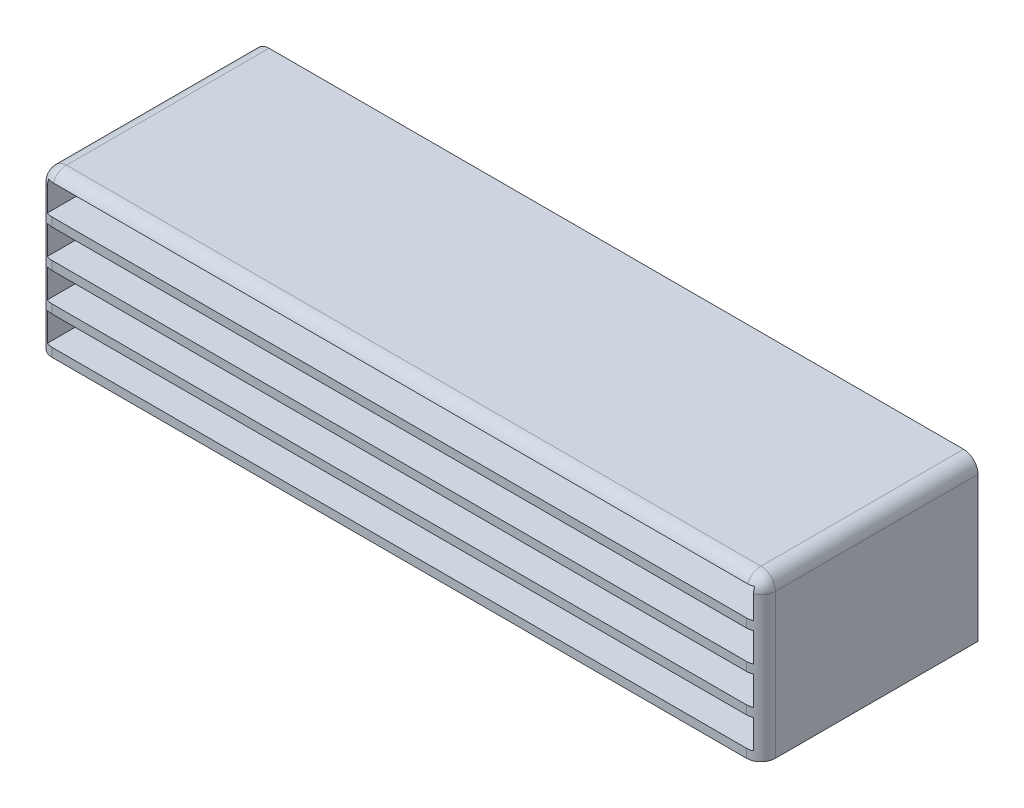
ISO-10303-21;
HEADER;
FILE_DESCRIPTION(('STEP AP214'),'2;1');
FILE_NAME('part.step','',(''),(''),'','','');
FILE_SCHEMA(('AUTOMOTIVE_DESIGN { 1 0 10303 214 1 1 1 1 }'));
ENDSEC;
DATA;
#1=APPLICATION_CONTEXT('core data for automotive mechanical design processes');
#2=APPLICATION_PROTOCOL_DEFINITION('international standard','automotive_design',2000,#1);
#3=PRODUCT_CONTEXT('',#1,'mechanical');
#4=PRODUCT('Part','Part','',(#3));
#5=PRODUCT_RELATED_PRODUCT_CATEGORY('part','',(#4));
#6=PRODUCT_DEFINITION_FORMATION('','',#4);
#7=PRODUCT_DEFINITION_CONTEXT('part definition',#1,'design');
#8=PRODUCT_DEFINITION('design','',#6,#7);
#9=PRODUCT_DEFINITION_SHAPE('','',#8);
#10=(LENGTH_UNIT() NAMED_UNIT(*) SI_UNIT(.MILLI.,.METRE.));
#11=(NAMED_UNIT(*) PLANE_ANGLE_UNIT() SI_UNIT($,.RADIAN.));
#12=(NAMED_UNIT(*) SI_UNIT($,.STERADIAN.) SOLID_ANGLE_UNIT());
#13=UNCERTAINTY_MEASURE_WITH_UNIT(LENGTH_MEASURE(1.E-05),#10,'distance_accuracy_value','');
#14=(GEOMETRIC_REPRESENTATION_CONTEXT(3) GLOBAL_UNCERTAINTY_ASSIGNED_CONTEXT((#13)) GLOBAL_UNIT_ASSIGNED_CONTEXT((#10,
#11,#12)) REPRESENTATION_CONTEXT('',''));
#15=CARTESIAN_POINT('',(0.,0.,0.));
#16=DIRECTION('',(0.,0.,1.));
#17=DIRECTION('',(1.,0.,0.));
#18=AXIS2_PLACEMENT_3D('',#15,#16,#17);
#19=CARTESIAN_POINT('',(0.,0.,75.));
#20=DIRECTION('',(0.,0.,1.));
#21=DIRECTION('',(1.,0.,0.));
#22=AXIS2_PLACEMENT_3D('',#19,#20,#21);
#23=PLANE('',#22);
#24=DIRECTION('',(1.,0.,0.));
#25=VECTOR('',#24,1.);
#26=CARTESIAN_POINT('',(0.,23.9541202925441,75.));
#27=LINE('',#26,#25);
#28=CARTESIAN_POINT('',(-76.8542907423635,23.9541202925441,75.));
#29=VERTEX_POINT('',#28);
#30=CARTESIAN_POINT('',(163.145709257637,23.9541202925441,75.));
#31=VERTEX_POINT('',#30);
#32=EDGE_CURVE('E445',#29,#31,#27,.T.);
#33=ORIENTED_EDGE('',*,*,#32,.T.);
#34=DIRECTION('',(0.,-1.,0.));
#35=VECTOR('',#34,1.);
#36=CARTESIAN_POINT('',(163.145709257637,0.,75.));
#37=LINE('',#36,#35);
#38=CARTESIAN_POINT('',(163.145709257637,26.9541202925441,75.));
#39=VERTEX_POINT('',#38);
#40=EDGE_CURVE('E375',#31,#39,#37,.F.);
#41=ORIENTED_EDGE('',*,*,#40,.T.);
#42=DIRECTION('',(1.,0.,0.));
#43=VECTOR('',#42,1.);
#44=CARTESIAN_POINT('',(0.,26.9541202925441,75.));
#45=LINE('',#44,#43);
#46=CARTESIAN_POINT('',(-76.8542907423632,26.9541202925441,75.));
#47=VERTEX_POINT('',#46);
#48=EDGE_CURVE('E450',#47,#39,#45,.T.);
#49=ORIENTED_EDGE('',*,*,#48,.F.);
#50=DIRECTION('',(0.,-1.,0.));
#51=VECTOR('',#50,1.);
#52=CARTESIAN_POINT('',(-76.8542907423635,23.954120292544,75.));
#53=LINE('',#52,#51);
#54=EDGE_CURVE('E361',#47,#29,#53,.T.);
#55=ORIENTED_EDGE('',*,*,#54,.T.);
#56=EDGE_LOOP('',(#33,#41,#49,#55));
#57=FACE_BOUND('',#56,.T.);
#58=ADVANCED_FACE('F41',(#57),#23,.T.);
#59=DIRECTION('',(1.,0.,0.));
#60=VECTOR('',#59,1.);
#61=CARTESIAN_POINT('',(0.,36.9541202925441,75.));
#62=LINE('',#61,#60);
#63=CARTESIAN_POINT('',(-76.8542907423633,36.9541202925441,75.));
#64=VERTEX_POINT('',#63);
#65=CARTESIAN_POINT('',(163.145709257637,36.9541202925441,75.));
#66=VERTEX_POINT('',#65);
#67=EDGE_CURVE('E456',#64,#66,#62,.T.);
#68=ORIENTED_EDGE('',*,*,#67,.T.);
#69=DIRECTION('',(0.,-1.,0.));
#70=VECTOR('',#69,1.);
#71=CARTESIAN_POINT('',(163.145709257637,0.,75.));
#72=LINE('',#71,#70);
#73=CARTESIAN_POINT('',(163.145709257637,39.9541202925441,75.));
#74=VERTEX_POINT('',#73);
#75=EDGE_CURVE('E373',#66,#74,#72,.F.);
#76=ORIENTED_EDGE('',*,*,#75,.T.);
#77=DIRECTION('',(1.,0.,0.));
#78=VECTOR('',#77,1.);
#79=CARTESIAN_POINT('',(0.,39.9541202925441,75.));
#80=LINE('',#79,#78);
#81=CARTESIAN_POINT('',(-76.8542907423632,39.9541202925441,75.));
#82=VERTEX_POINT('',#81);
#83=EDGE_CURVE('E461',#82,#74,#80,.T.);
#84=ORIENTED_EDGE('',*,*,#83,.F.);
#85=DIRECTION('',(0.,-1.,0.));
#86=VECTOR('',#85,1.);
#87=CARTESIAN_POINT('',(-76.8542907423635,23.954120292544,75.));
#88=LINE('',#87,#86);
#89=EDGE_CURVE('E363',#82,#64,#88,.T.);
#90=ORIENTED_EDGE('',*,*,#89,.T.);
#91=EDGE_LOOP('',(#68,#76,#84,#90));
#92=FACE_BOUND('',#91,.T.);
#93=ADVANCED_FACE('F531',(#92),#23,.T.);
#94=DIRECTION('',(1.,0.,0.));
#95=VECTOR('',#94,1.);
#96=CARTESIAN_POINT('',(0.,49.9541202925441,75.));
#97=LINE('',#96,#95);
#98=CARTESIAN_POINT('',(-76.8542907423632,49.9541202925441,75.));
#99=VERTEX_POINT('',#98);
#100=CARTESIAN_POINT('',(163.145709257637,49.9541202925441,75.));
#101=VERTEX_POINT('',#100);
#102=EDGE_CURVE('E464',#99,#101,#97,.T.);
#103=ORIENTED_EDGE('',*,*,#102,.T.);
#104=DIRECTION('',(0.,-1.,0.));
#105=VECTOR('',#104,1.);
#106=CARTESIAN_POINT('',(163.145709257637,0.,75.));
#107=LINE('',#106,#105);
#108=CARTESIAN_POINT('',(163.145709257637,52.9541202925441,75.));
#109=VERTEX_POINT('',#108);
#110=EDGE_CURVE('E371',#101,#109,#107,.F.);
#111=ORIENTED_EDGE('',*,*,#110,.T.);
#112=DIRECTION('',(1.,0.,0.));
#113=VECTOR('',#112,1.);
#114=CARTESIAN_POINT('',(0.,52.9541202925441,75.));
#115=LINE('',#114,#113);
#116=CARTESIAN_POINT('',(-76.8542907423632,52.9541202925441,75.));
#117=VERTEX_POINT('',#116);
#118=EDGE_CURVE('E467',#117,#109,#115,.T.);
#119=ORIENTED_EDGE('',*,*,#118,.F.);
#120=DIRECTION('',(0.,-1.,0.));
#121=VECTOR('',#120,1.);
#122=CARTESIAN_POINT('',(-76.8542907423635,23.954120292544,75.));
#123=LINE('',#122,#121);
#124=EDGE_CURVE('E365',#117,#99,#123,.T.);
#125=ORIENTED_EDGE('',*,*,#124,.T.);
#126=EDGE_LOOP('',(#103,#111,#119,#125));
#127=FACE_BOUND('',#126,.T.);
#128=ADVANCED_FACE('F561',(#127),#23,.T.);
#129=CARTESIAN_POINT('',(0.,23.9541202925441,3.));
#130=DIRECTION('',(0.,1.,0.));
#131=DIRECTION('',(0.,0.,1.));
#132=AXIS2_PLACEMENT_3D('',#129,#130,#131);
#133=PLANE('',#132);
#134=DIRECTION('',(0.,0.,-1.));
#135=VECTOR('',#134,1.);
#136=CARTESIAN_POINT('',(168.145709257637,23.9541202925441,3.));
#137=LINE('',#136,#135);
#138=CARTESIAN_POINT('',(168.145709257637,23.9541202925441,70.));
#139=VERTEX_POINT('',#138);
#140=CARTESIAN_POINT('',(168.145709257637,23.9541202925441,0.));
#141=VERTEX_POINT('',#140);
#142=EDGE_CURVE('E339',#139,#141,#137,.T.);
#143=ORIENTED_EDGE('',*,*,#142,.F.);
#144=CARTESIAN_POINT('',(163.145709257637,23.9541202925441,70.));
#145=DIRECTION('',(0.,1.,0.));
#146=DIRECTION('',(0.,0.,1.));
#147=AXIS2_PLACEMENT_3D('',#144,#145,#146);
#148=CIRCLE('',#147,5.);
#149=EDGE_CURVE('E359',#139,#31,#148,.F.);
#150=ORIENTED_EDGE('',*,*,#149,.T.);
#151=ORIENTED_EDGE('',*,*,#32,.F.);
#152=CARTESIAN_POINT('',(-76.8542907423635,23.9541202925441,70.));
#153=DIRECTION('',(0.,1.,0.));
#154=DIRECTION('',(0.,0.,1.));
#155=AXIS2_PLACEMENT_3D('',#152,#153,#154);
#156=CIRCLE('',#155,5.);
#157=CARTESIAN_POINT('',(-81.854290742363,23.9541202925441,70.));
#158=VERTEX_POINT('',#157);
#159=EDGE_CURVE('E357',#29,#158,#156,.F.);
#160=ORIENTED_EDGE('',*,*,#159,.T.);
#161=DIRECTION('',(0.,0.,-1.));
#162=VECTOR('',#161,1.);
#163=CARTESIAN_POINT('',(-81.854290742363,23.9541202925441,3.));
#164=LINE('',#163,#162);
#165=CARTESIAN_POINT('',(-81.854290742363,23.9541202925441,0.));
#166=VERTEX_POINT('',#165);
#167=EDGE_CURVE('E337',#158,#166,#164,.T.);
#168=ORIENTED_EDGE('',*,*,#167,.T.);
#169=DIRECTION('',(1.,0.,0.));
#170=VECTOR('',#169,1.);
#171=CARTESIAN_POINT('',(0.,23.9541202925441,0.));
#172=LINE('',#171,#170);
#173=EDGE_CURVE('E274',#166,#141,#172,.T.);
#174=ORIENTED_EDGE('',*,*,#173,.T.);
#175=EDGE_LOOP('',(#143,#150,#151,#160,#168,#174));
#176=FACE_BOUND('',#175,.T.);
#177=ADVANCED_FACE('F623',(#176),#133,.F.);
#178=CARTESIAN_POINT('',(168.145709257637,0.,3.));
#179=DIRECTION('',(1.,0.,0.));
#180=DIRECTION('',(0.,0.,-1.));
#181=AXIS2_PLACEMENT_3D('',#178,#179,#180);
#182=PLANE('',#181);
#183=DIRECTION('',(0.,0.,-1.));
#184=VECTOR('',#183,1.);
#185=CARTESIAN_POINT('',(168.145709257637,73.9541202925441,3.));
#186=LINE('',#185,#184);
#187=CARTESIAN_POINT('',(168.145709257637,73.9541202925441,0.));
#188=VERTEX_POINT('',#187);
#189=CARTESIAN_POINT('',(168.145709257637,73.9541202925441,70.));
#190=VERTEX_POINT('',#189);
#191=EDGE_CURVE('E349',#188,#190,#186,.F.);
#192=ORIENTED_EDGE('',*,*,#191,.T.);
#193=DIRECTION('',(0.,-1.,0.));
#194=VECTOR('',#193,1.);
#195=CARTESIAN_POINT('',(168.145709257637,0.,70.));
#196=LINE('',#195,#194);
#197=EDGE_CURVE('E354',#190,#139,#196,.T.);
#198=ORIENTED_EDGE('',*,*,#197,.T.);
#199=ORIENTED_EDGE('',*,*,#142,.T.);
#200=DIRECTION('',(0.,-1.,0.));
#201=VECTOR('',#200,1.);
#202=CARTESIAN_POINT('',(168.145709257637,0.,0.));
#203=LINE('',#202,#201);
#204=EDGE_CURVE('E328',#188,#141,#203,.T.);
#205=ORIENTED_EDGE('',*,*,#204,.F.);
#206=EDGE_LOOP('',(#192,#198,#199,#205));
#207=FACE_BOUND('',#206,.T.);
#208=ADVANCED_FACE('F616',(#207),#182,.T.);
#209=CARTESIAN_POINT('',(0.,78.9541202925441,3.));
#210=DIRECTION('',(0.,1.,0.));
#211=DIRECTION('',(0.,0.,1.));
#212=AXIS2_PLACEMENT_3D('',#209,#210,#211);
#213=PLANE('',#212);
#214=DIRECTION('',(0.,0.,-1.));
#215=VECTOR('',#214,1.);
#216=CARTESIAN_POINT('',(-76.854290742363,78.9541202925441,75.));
#217=LINE('',#216,#215);
#218=CARTESIAN_POINT('',(-76.854290742363,78.9541202925441,0.));
#219=VERTEX_POINT('',#218);
#220=CARTESIAN_POINT('',(-76.854290742363,78.9541202925441,70.));
#221=VERTEX_POINT('',#220);
#222=EDGE_CURVE('E341',#219,#221,#217,.F.);
#223=ORIENTED_EDGE('',*,*,#222,.T.);
#224=DIRECTION('',(1.,0.,0.));
#225=VECTOR('',#224,1.);
#226=CARTESIAN_POINT('',(0.,78.9541202925441,70.));
#227=LINE('',#226,#225);
#228=CARTESIAN_POINT('',(163.145709257637,78.9541202925441,70.));
#229=VERTEX_POINT('',#228);
#230=EDGE_CURVE('E50',#221,#229,#227,.T.);
#231=ORIENTED_EDGE('',*,*,#230,.T.);
#232=DIRECTION('',(0.,0.,-1.));
#233=VECTOR('',#232,1.);
#234=CARTESIAN_POINT('',(163.145709257637,78.9541202925441,3.));
#235=LINE('',#234,#233);
#236=CARTESIAN_POINT('',(163.145709257637,78.9541202925441,0.));
#237=VERTEX_POINT('',#236);
#238=EDGE_CURVE('E343',#229,#237,#235,.T.);
#239=ORIENTED_EDGE('',*,*,#238,.T.);
#240=DIRECTION('',(1.,0.,0.));
#241=VECTOR('',#240,1.);
#242=CARTESIAN_POINT('',(0.,78.9541202925441,0.));
#243=LINE('',#242,#241);
#244=EDGE_CURVE('E331',#219,#237,#243,.T.);
#245=ORIENTED_EDGE('',*,*,#244,.F.);
#246=EDGE_LOOP('',(#223,#231,#239,#245));
#247=FACE_BOUND('',#246,.T.);
#248=ADVANCED_FACE('F630',(#247),#213,.T.);
#249=CARTESIAN_POINT('',(-81.8542907423637,7.57304318721116E-13,3.));
#250=DIRECTION('',(1.,0.,0.));
#251=DIRECTION('',(0.,1.,0.));
#252=AXIS2_PLACEMENT_3D('',#249,#250,#251);
#253=PLANE('',#252);
#254=ORIENTED_EDGE('',*,*,#167,.F.);
#255=DIRECTION('',(0.,-1.,0.));
#256=VECTOR('',#255,1.);
#257=CARTESIAN_POINT('',(-81.854290742363,73.9541202925441,70.));
#258=LINE('',#257,#256);
#259=CARTESIAN_POINT('',(-81.854290742363,73.9541202925441,70.));
#260=VERTEX_POINT('',#259);
#261=EDGE_CURVE('E430',#158,#260,#258,.F.);
#262=ORIENTED_EDGE('',*,*,#261,.T.);
#263=DIRECTION('',(0.,0.,-1.));
#264=VECTOR('',#263,1.);
#265=CARTESIAN_POINT('',(-81.854290742363,73.9541202925441,0.));
#266=LINE('',#265,#264);
#267=CARTESIAN_POINT('',(-81.854290742363,73.9541202925441,0.));
#268=VERTEX_POINT('',#267);
#269=EDGE_CURVE('E352',#260,#268,#266,.T.);
#270=ORIENTED_EDGE('',*,*,#269,.T.);
#271=DIRECTION('',(0.,-1.,0.));
#272=VECTOR('',#271,1.);
#273=CARTESIAN_POINT('',(-81.8542907423637,7.57304318721116E-13,0.));
#274=LINE('',#273,#272);
#275=EDGE_CURVE('E334',#268,#166,#274,.T.);
#276=ORIENTED_EDGE('',*,*,#275,.T.);
#277=EDGE_LOOP('',(#254,#262,#270,#276));
#278=FACE_BOUND('',#277,.T.);
#279=ADVANCED_FACE('F627',(#278),#253,.F.);
#280=CARTESIAN_POINT('',(0.,0.,0.));
#281=DIRECTION('',(0.,0.,1.));
#282=DIRECTION('',(1.,0.,0.));
#283=AXIS2_PLACEMENT_3D('',#280,#281,#282);
#284=PLANE('',#283);
#285=ORIENTED_EDGE('',*,*,#244,.T.);
#286=CARTESIAN_POINT('',(163.145709257637,73.9541202925441,0.));
#287=DIRECTION('',(0.,0.,1.));
#288=DIRECTION('',(1.,0.,0.));
#289=AXIS2_PLACEMENT_3D('',#286,#287,#288);
#290=CIRCLE('',#289,5.);
#291=EDGE_CURVE('E347',#237,#188,#290,.F.);
#292=ORIENTED_EDGE('',*,*,#291,.T.);
#293=ORIENTED_EDGE('',*,*,#204,.T.);
#294=ORIENTED_EDGE('',*,*,#173,.F.);
#295=ORIENTED_EDGE('',*,*,#275,.F.);
#296=CARTESIAN_POINT('',(-76.854290742363,73.9541202925441,0.));
#297=DIRECTION('',(0.,0.,1.));
#298=DIRECTION('',(1.,0.,0.));
#299=AXIS2_PLACEMENT_3D('',#296,#297,#298);
#300=CIRCLE('',#299,5.);
#301=EDGE_CURVE('E345',#268,#219,#300,.F.);
#302=ORIENTED_EDGE('',*,*,#301,.T.);
#303=EDGE_LOOP('',(#285,#292,#293,#294,#295,#302));
#304=FACE_BOUND('',#303,.T.);
#305=ADVANCED_FACE('F620',(#304),#284,.F.);
#306=CARTESIAN_POINT('',(-78.854290742363,0.,75.));
#307=DIRECTION('',(1.,0.,0.));
#308=DIRECTION('',(0.,0.,-1.));
#309=AXIS2_PLACEMENT_3D('',#306,#307,#308);
#310=PLANE('',#309);
#311=DIRECTION('',(0.,0.,-1.));
#312=VECTOR('',#311,1.);
#313=CARTESIAN_POINT('',(-78.854290742363,75.9541202925441,75.));
#314=LINE('',#313,#312);
#315=CARTESIAN_POINT('',(-78.854290742363,75.9541202925441,74.1231056256177));
#316=VERTEX_POINT('',#315);
#317=CARTESIAN_POINT('',(-78.854290742363,75.9541202925441,3.));
#318=VERTEX_POINT('',#317);
#319=EDGE_CURVE('E280',#316,#318,#314,.T.);
#320=ORIENTED_EDGE('',*,*,#319,.F.);
#321=CARTESIAN_POINT('',(-78.854290742363,73.9541202925441,70.));
#322=DIRECTION('',(1.,0.,0.));
#323=DIRECTION('',(0.,0.,-1.));
#324=AXIS2_PLACEMENT_3D('',#321,#322,#323);
#325=CIRCLE('',#324,4.58257569495585);
#326=CARTESIAN_POINT('',(-78.8542907423623,73.9541202925441,74.5825756949561));
#327=VERTEX_POINT('',#326);
#328=EDGE_CURVE('E422',#316,#327,#325,.T.);
#329=ORIENTED_EDGE('',*,*,#328,.T.);
#330=DIRECTION('',(0.,1.,0.));
#331=VECTOR('',#330,1.);
#332=CARTESIAN_POINT('',(-78.854290742363,7.11045026028401E-13,74.5825756949561));
#333=LINE('',#332,#331);
#334=CARTESIAN_POINT('',(-78.854290742363,65.9541202925441,74.5825756949559));
#335=VERTEX_POINT('',#334);
#336=EDGE_CURVE('E258',#327,#335,#333,.F.);
#337=ORIENTED_EDGE('',*,*,#336,.T.);
#338=DIRECTION('',(0.,0.,-1.));
#339=VECTOR('',#338,1.);
#340=CARTESIAN_POINT('',(-78.854290742363,65.9541202925441,75.));
#341=LINE('',#340,#339);
#342=CARTESIAN_POINT('',(-78.854290742363,65.9541202925441,3.));
#343=VERTEX_POINT('',#342);
#344=EDGE_CURVE('E252',#335,#343,#341,.T.);
#345=ORIENTED_EDGE('',*,*,#344,.T.);
#346=DIRECTION('',(0.,1.,0.));
#347=VECTOR('',#346,1.);
#348=CARTESIAN_POINT('',(-78.854290742363,0.,3.));
#349=LINE('',#348,#347);
#350=EDGE_CURVE('E256',#343,#318,#349,.T.);
#351=ORIENTED_EDGE('',*,*,#350,.T.);
#352=EDGE_LOOP('',(#320,#329,#337,#345,#351));
#353=FACE_BOUND('',#352,.T.);
#354=ADVANCED_FACE('F255',(#353),#310,.T.);
#355=CARTESIAN_POINT('',(0.,75.9541202925441,75.));
#356=DIRECTION('',(0.,1.,0.));
#357=DIRECTION('',(0.,0.,1.));
#358=AXIS2_PLACEMENT_3D('',#355,#356,#357);
#359=PLANE('',#358);
#360=DIRECTION('',(0.,0.,-1.));
#361=VECTOR('',#360,1.);
#362=CARTESIAN_POINT('',(165.145709257637,75.9541202925441,75.));
#363=LINE('',#362,#361);
#364=CARTESIAN_POINT('',(165.145709257637,75.9541202925441,74.1231056256177));
#365=VERTEX_POINT('',#364);
#366=CARTESIAN_POINT('',(165.145709257637,75.9541202925441,3.));
#367=VERTEX_POINT('',#366);
#368=EDGE_CURVE('E285',#365,#367,#363,.T.);
#369=ORIENTED_EDGE('',*,*,#368,.F.);
#370=CARTESIAN_POINT('',(163.145709257637,75.9541202925441,70.));
#371=DIRECTION('',(0.,1.,0.));
#372=DIRECTION('',(0.,0.,1.));
#373=AXIS2_PLACEMENT_3D('',#370,#371,#372);
#374=CIRCLE('',#373,4.58257569495584);
#375=CARTESIAN_POINT('',(163.145709257637,75.9541202925441,74.5825756949558));
#376=VERTEX_POINT('',#375);
#377=EDGE_CURVE('E419',#365,#376,#374,.F.);
#378=ORIENTED_EDGE('',*,*,#377,.T.);
#379=DIRECTION('',(1.,0.,0.));
#380=VECTOR('',#379,1.);
#381=CARTESIAN_POINT('',(0.,75.9541202925441,74.5825756949558));
#382=LINE('',#381,#380);
#383=CARTESIAN_POINT('',(-76.854290742363,75.9541202925441,74.5825756949558));
#384=VERTEX_POINT('',#383);
#385=EDGE_CURVE('E417',#376,#384,#382,.F.);
#386=ORIENTED_EDGE('',*,*,#385,.T.);
#387=CARTESIAN_POINT('',(-76.854290742363,75.9541202925441,70.));
#388=DIRECTION('',(0.,1.,0.));
#389=DIRECTION('',(0.,0.,1.));
#390=AXIS2_PLACEMENT_3D('',#387,#388,#389);
#391=CIRCLE('',#390,4.58257569495584);
#392=EDGE_CURVE('E415',#384,#316,#391,.F.);
#393=ORIENTED_EDGE('',*,*,#392,.T.);
#394=ORIENTED_EDGE('',*,*,#319,.T.);
#395=DIRECTION('',(-1.,0.,0.));
#396=VECTOR('',#395,1.);
#397=CARTESIAN_POINT('',(0.,75.9541202925441,3.));
#398=LINE('',#397,#396);
#399=EDGE_CURVE('E273',#367,#318,#398,.T.);
#400=ORIENTED_EDGE('',*,*,#399,.F.);
#401=EDGE_LOOP('',(#369,#378,#386,#393,#394,#400));
#402=FACE_BOUND('',#401,.T.);
#403=ADVANCED_FACE('F600',(#402),#359,.F.);
#404=CARTESIAN_POINT('',(165.145709257637,0.,75.));
#405=DIRECTION('',(1.,0.,0.));
#406=DIRECTION('',(0.,1.,0.));
#407=AXIS2_PLACEMENT_3D('',#404,#405,#406);
#408=PLANE('',#407);
#409=DIRECTION('',(0.,0.,-1.));
#410=VECTOR('',#409,1.);
#411=CARTESIAN_POINT('',(165.145709257637,65.9541202925441,75.));
#412=LINE('',#411,#410);
#413=CARTESIAN_POINT('',(165.145709257637,65.9541202925441,74.5825756949558));
#414=VERTEX_POINT('',#413);
#415=CARTESIAN_POINT('',(165.145709257637,65.9541202925441,3.));
#416=VERTEX_POINT('',#415);
#417=EDGE_CURVE('E262',#414,#416,#412,.T.);
#418=ORIENTED_EDGE('',*,*,#417,.F.);
#419=DIRECTION('',(0.,-1.,0.));
#420=VECTOR('',#419,1.);
#421=CARTESIAN_POINT('',(165.145709257637,0.,74.5825756949558));
#422=LINE('',#421,#420);
#423=CARTESIAN_POINT('',(165.145709257637,73.9541202925441,74.5825756949558));
#424=VERTEX_POINT('',#423);
#425=EDGE_CURVE('E413',#414,#424,#422,.F.);
#426=ORIENTED_EDGE('',*,*,#425,.T.);
#427=CARTESIAN_POINT('',(165.145709257637,73.9541202925441,70.));
#428=DIRECTION('',(1.,0.,0.));
#429=DIRECTION('',(0.,1.,0.));
#430=AXIS2_PLACEMENT_3D('',#427,#428,#429);
#431=CIRCLE('',#430,4.58257569495585);
#432=EDGE_CURVE('E411',#424,#365,#431,.F.);
#433=ORIENTED_EDGE('',*,*,#432,.T.);
#434=ORIENTED_EDGE('',*,*,#368,.T.);
#435=DIRECTION('',(0.,1.,0.));
#436=VECTOR('',#435,1.);
#437=CARTESIAN_POINT('',(165.145709257637,0.,3.));
#438=LINE('',#437,#436);
#439=EDGE_CURVE('E323',#416,#367,#438,.T.);
#440=ORIENTED_EDGE('',*,*,#439,.F.);
#441=EDGE_LOOP('',(#418,#426,#433,#434,#440));
#442=FACE_BOUND('',#441,.T.);
#443=ADVANCED_FACE('F596',(#442),#408,.F.);
#444=CARTESIAN_POINT('',(165.145709257637,0.,75.));
#445=DIRECTION('',(1.,0.,0.));
#446=DIRECTION('',(0.,1.,0.));
#447=AXIS2_PLACEMENT_3D('',#444,#445,#446);
#448=PLANE('',#447);
#449=DIRECTION('',(0.,0.,-1.));
#450=VECTOR('',#449,1.);
#451=CARTESIAN_POINT('',(165.145709257637,52.9541202925441,75.));
#452=LINE('',#451,#450);
#453=CARTESIAN_POINT('',(165.145709257637,52.9541202925441,74.5825756949558));
#454=VERTEX_POINT('',#453);
#455=CARTESIAN_POINT('',(165.145709257637,52.9541202925441,3.));
#456=VERTEX_POINT('',#455);
#457=EDGE_CURVE('E263',#454,#456,#452,.T.);
#458=ORIENTED_EDGE('',*,*,#457,.F.);
#459=DIRECTION('',(0.,-1.,0.));
#460=VECTOR('',#459,1.);
#461=CARTESIAN_POINT('',(165.145709257637,52.9541202925441,74.5825756949558));
#462=LINE('',#461,#460);
#463=CARTESIAN_POINT('',(165.145709257637,62.9541202925441,74.5825756949558));
#464=VERTEX_POINT('',#463);
#465=EDGE_CURVE('E401',#454,#464,#462,.F.);
#466=ORIENTED_EDGE('',*,*,#465,.T.);
#467=DIRECTION('',(0.,0.,-1.));
#468=VECTOR('',#467,1.);
#469=CARTESIAN_POINT('',(165.145709257637,62.9541202925441,75.));
#470=LINE('',#469,#468);
#471=CARTESIAN_POINT('',(165.145709257637,62.9541202925441,3.));
#472=VERTEX_POINT('',#471);
#473=EDGE_CURVE('E478',#464,#472,#470,.T.);
#474=ORIENTED_EDGE('',*,*,#473,.T.);
#475=DIRECTION('',(0.,1.,0.));
#476=VECTOR('',#475,1.);
#477=CARTESIAN_POINT('',(165.145709257637,0.,3.));
#478=LINE('',#477,#476);
#479=EDGE_CURVE('E320',#456,#472,#478,.T.);
#480=ORIENTED_EDGE('',*,*,#479,.F.);
#481=EDGE_LOOP('',(#458,#466,#474,#480));
#482=FACE_BOUND('',#481,.T.);
#483=ADVANCED_FACE('F571',(#482),#448,.F.);
#484=CARTESIAN_POINT('',(0.,52.9541202925441,75.));
#485=DIRECTION('',(0.,1.,0.));
#486=DIRECTION('',(0.,0.,1.));
#487=AXIS2_PLACEMENT_3D('',#484,#485,#486);
#488=PLANE('',#487);
#489=ORIENTED_EDGE('',*,*,#118,.T.);
#490=CARTESIAN_POINT('',(163.145709257637,52.9541202925441,70.));
#491=DIRECTION('',(0.,1.,0.));
#492=DIRECTION('',(0.,0.,1.));
#493=AXIS2_PLACEMENT_3D('',#490,#491,#492);
#494=CIRCLE('',#493,5.);
#495=EDGE_CURVE('E399',#109,#454,#494,.T.);
#496=ORIENTED_EDGE('',*,*,#495,.T.);
#497=ORIENTED_EDGE('',*,*,#457,.T.);
#498=DIRECTION('',(-1.,0.,0.));
#499=VECTOR('',#498,1.);
#500=CARTESIAN_POINT('',(0.,52.9541202925441,3.));
#501=LINE('',#500,#499);
#502=CARTESIAN_POINT('',(-78.854290742363,52.9541202925441,3.));
#503=VERTEX_POINT('',#502);
#504=EDGE_CURVE('E317',#456,#503,#501,.T.);
#505=ORIENTED_EDGE('',*,*,#504,.T.);
#506=DIRECTION('',(0.,0.,-1.));
#507=VECTOR('',#506,1.);
#508=CARTESIAN_POINT('',(-78.854290742363,52.9541202925441,75.));
#509=LINE('',#508,#507);
#510=CARTESIAN_POINT('',(-78.854290742363,52.9541202925441,74.5825756949559));
#511=VERTEX_POINT('',#510);
#512=EDGE_CURVE('E483',#511,#503,#509,.T.);
#513=ORIENTED_EDGE('',*,*,#512,.F.);
#514=CARTESIAN_POINT('',(-76.8542907423632,52.9541202925441,70.));
#515=DIRECTION('',(0.,1.,0.));
#516=DIRECTION('',(0.,0.,1.));
#517=AXIS2_PLACEMENT_3D('',#514,#515,#516);
#518=CIRCLE('',#517,5.);
#519=EDGE_CURVE('E397',#511,#117,#518,.T.);
#520=ORIENTED_EDGE('',*,*,#519,.T.);
#521=EDGE_LOOP('',(#489,#496,#497,#505,#513,#520));
#522=FACE_BOUND('',#521,.T.);
#523=ADVANCED_FACE('F568',(#522),#488,.T.);
#524=CARTESIAN_POINT('',(-78.854290742363,0.,75.));
#525=DIRECTION('',(1.,0.,0.));
#526=DIRECTION('',(0.,0.,-1.));
#527=AXIS2_PLACEMENT_3D('',#524,#525,#526);
#528=PLANE('',#527);
#529=DIRECTION('',(0.,0.,-1.));
#530=VECTOR('',#529,1.);
#531=CARTESIAN_POINT('',(-78.854290742363,62.9541202925441,75.));
#532=LINE('',#531,#530);
#533=CARTESIAN_POINT('',(-78.854290742363,62.9541202925441,74.5825756949559));
#534=VERTEX_POINT('',#533);
#535=CARTESIAN_POINT('',(-78.854290742363,62.9541202925441,3.));
#536=VERTEX_POINT('',#535);
#537=EDGE_CURVE('E480',#534,#536,#532,.T.);
#538=ORIENTED_EDGE('',*,*,#537,.F.);
#539=DIRECTION('',(0.,1.,0.));
#540=VECTOR('',#539,1.);
#541=CARTESIAN_POINT('',(-78.854290742363,62.9541202925441,74.5825756949559));
#542=LINE('',#541,#540);
#543=EDGE_CURVE('E424',#534,#511,#542,.F.);
#544=ORIENTED_EDGE('',*,*,#543,.T.);
#545=ORIENTED_EDGE('',*,*,#512,.T.);
#546=DIRECTION('',(0.,1.,0.));
#547=VECTOR('',#546,1.);
#548=CARTESIAN_POINT('',(-78.854290742363,0.,3.));
#549=LINE('',#548,#547);
#550=EDGE_CURVE('E314',#503,#536,#549,.T.);
#551=ORIENTED_EDGE('',*,*,#550,.T.);
#552=EDGE_LOOP('',(#538,#544,#545,#551));
#553=FACE_BOUND('',#552,.T.);
#554=ADVANCED_FACE('F585',(#553),#528,.T.);
#555=CARTESIAN_POINT('',(165.145709257637,0.,75.));
#556=DIRECTION('',(1.,0.,0.));
#557=DIRECTION('',(0.,1.,0.));
#558=AXIS2_PLACEMENT_3D('',#555,#556,#557);
#559=PLANE('',#558);
#560=DIRECTION('',(0.,0.,-1.));
#561=VECTOR('',#560,1.);
#562=CARTESIAN_POINT('',(165.145709257637,39.9541202925441,75.));
#563=LINE('',#562,#561);
#564=CARTESIAN_POINT('',(165.145709257637,39.9541202925441,74.5825756949558));
#565=VERTEX_POINT('',#564);
#566=CARTESIAN_POINT('',(165.145709257637,39.9541202925441,3.));
#567=VERTEX_POINT('',#566);
#568=EDGE_CURVE('E481',#565,#567,#563,.T.);
#569=ORIENTED_EDGE('',*,*,#568,.F.);
#570=DIRECTION('',(0.,-1.,0.));
#571=VECTOR('',#570,1.);
#572=CARTESIAN_POINT('',(165.145709257637,39.9541202925441,74.5825756949558));
#573=LINE('',#572,#571);
#574=CARTESIAN_POINT('',(165.145709257637,49.9541202925441,74.5825756949558));
#575=VERTEX_POINT('',#574);
#576=EDGE_CURVE('E391',#565,#575,#573,.F.);
#577=ORIENTED_EDGE('',*,*,#576,.T.);
#578=DIRECTION('',(0.,0.,-1.));
#579=VECTOR('',#578,1.);
#580=CARTESIAN_POINT('',(165.145709257637,49.9541202925441,75.));
#581=LINE('',#580,#579);
#582=CARTESIAN_POINT('',(165.145709257637,49.9541202925441,3.));
#583=VERTEX_POINT('',#582);
#584=EDGE_CURVE('E486',#575,#583,#581,.T.);
#585=ORIENTED_EDGE('',*,*,#584,.T.);
#586=DIRECTION('',(0.,1.,0.));
#587=VECTOR('',#586,1.);
#588=CARTESIAN_POINT('',(165.145709257637,0.,3.));
#589=LINE('',#588,#587);
#590=EDGE_CURVE('E311',#567,#583,#589,.T.);
#591=ORIENTED_EDGE('',*,*,#590,.F.);
#592=EDGE_LOOP('',(#569,#577,#585,#591));
#593=FACE_BOUND('',#592,.T.);
#594=ADVANCED_FACE('F541',(#593),#559,.F.);
#595=CARTESIAN_POINT('',(0.,39.9541202925441,75.));
#596=DIRECTION('',(0.,1.,0.));
#597=DIRECTION('',(-1.,0.,0.));
#598=AXIS2_PLACEMENT_3D('',#595,#596,#597);
#599=PLANE('',#598);
#600=ORIENTED_EDGE('',*,*,#83,.T.);
#601=CARTESIAN_POINT('',(163.145709257637,39.9541202925441,70.));
#602=DIRECTION('',(0.,1.,0.));
#603=DIRECTION('',(-1.,0.,0.));
#604=AXIS2_PLACEMENT_3D('',#601,#602,#603);
#605=CIRCLE('',#604,5.);
#606=EDGE_CURVE('E389',#74,#565,#605,.T.);
#607=ORIENTED_EDGE('',*,*,#606,.T.);
#608=ORIENTED_EDGE('',*,*,#568,.T.);
#609=DIRECTION('',(-1.,0.,0.));
#610=VECTOR('',#609,1.);
#611=CARTESIAN_POINT('',(0.,39.9541202925441,3.));
#612=LINE('',#611,#610);
#613=CARTESIAN_POINT('',(-78.854290742363,39.9541202925441,3.));
#614=VERTEX_POINT('',#613);
#615=EDGE_CURVE('E308',#567,#614,#612,.T.);
#616=ORIENTED_EDGE('',*,*,#615,.T.);
#617=DIRECTION('',(0.,0.,-1.));
#618=VECTOR('',#617,1.);
#619=CARTESIAN_POINT('',(-78.854290742363,39.9541202925441,75.));
#620=LINE('',#619,#618);
#621=CARTESIAN_POINT('',(-78.854290742363,39.9541202925441,74.582575694956));
#622=VERTEX_POINT('',#621);
#623=EDGE_CURVE('E490',#622,#614,#620,.T.);
#624=ORIENTED_EDGE('',*,*,#623,.F.);
#625=CARTESIAN_POINT('',(-76.8542907423633,39.9541202925441,70.));
#626=DIRECTION('',(0.,1.,0.));
#627=DIRECTION('',(-1.,0.,0.));
#628=AXIS2_PLACEMENT_3D('',#625,#626,#627);
#629=CIRCLE('',#628,5.);
#630=EDGE_CURVE('E387',#622,#82,#629,.T.);
#631=ORIENTED_EDGE('',*,*,#630,.T.);
#632=EDGE_LOOP('',(#600,#607,#608,#616,#624,#631));
#633=FACE_BOUND('',#632,.T.);
#634=ADVANCED_FACE('F538',(#633),#599,.T.);
#635=CARTESIAN_POINT('',(-78.854290742363,0.,75.));
#636=DIRECTION('',(1.,0.,0.));
#637=DIRECTION('',(0.,0.,-1.));
#638=AXIS2_PLACEMENT_3D('',#635,#636,#637);
#639=PLANE('',#638);
#640=DIRECTION('',(0.,0.,-1.));
#641=VECTOR('',#640,1.);
#642=CARTESIAN_POINT('',(-78.854290742363,49.9541202925441,75.));
#643=LINE('',#642,#641);
#644=CARTESIAN_POINT('',(-78.854290742363,49.9541202925441,74.582575694956));
#645=VERTEX_POINT('',#644);
#646=CARTESIAN_POINT('',(-78.854290742363,49.9541202925441,3.));
#647=VERTEX_POINT('',#646);
#648=EDGE_CURVE('E488',#645,#647,#643,.T.);
#649=ORIENTED_EDGE('',*,*,#648,.F.);
#650=DIRECTION('',(0.,1.,0.));
#651=VECTOR('',#650,1.);
#652=CARTESIAN_POINT('',(-78.854290742363,49.9541202925441,74.5825756949559));
#653=LINE('',#652,#651);
#654=EDGE_CURVE('E426',#645,#622,#653,.F.);
#655=ORIENTED_EDGE('',*,*,#654,.T.);
#656=ORIENTED_EDGE('',*,*,#623,.T.);
#657=DIRECTION('',(0.,1.,0.));
#658=VECTOR('',#657,1.);
#659=CARTESIAN_POINT('',(-78.854290742363,0.,3.));
#660=LINE('',#659,#658);
#661=EDGE_CURVE('E305',#614,#647,#660,.T.);
#662=ORIENTED_EDGE('',*,*,#661,.T.);
#663=EDGE_LOOP('',(#649,#655,#656,#662));
#664=FACE_BOUND('',#663,.T.);
#665=ADVANCED_FACE('F555',(#664),#639,.T.);
#666=CARTESIAN_POINT('',(165.145709257637,0.,75.));
#667=DIRECTION('',(1.,0.,0.));
#668=DIRECTION('',(0.,1.,0.));
#669=AXIS2_PLACEMENT_3D('',#666,#667,#668);
#670=PLANE('',#669);
#671=DIRECTION('',(0.,0.,-1.));
#672=VECTOR('',#671,1.);
#673=CARTESIAN_POINT('',(165.145709257637,26.9541202925441,75.));
#674=LINE('',#673,#672);
#675=CARTESIAN_POINT('',(165.145709257637,26.9541202925441,74.5825756949558));
#676=VERTEX_POINT('',#675);
#677=CARTESIAN_POINT('',(165.145709257637,26.9541202925441,3.));
#678=VERTEX_POINT('',#677);
#679=EDGE_CURVE('E288',#676,#678,#674,.T.);
#680=ORIENTED_EDGE('',*,*,#679,.F.);
#681=DIRECTION('',(0.,-1.,0.));
#682=VECTOR('',#681,1.);
#683=CARTESIAN_POINT('',(165.145709257637,26.9541202925441,74.5825756949558));
#684=LINE('',#683,#682);
#685=CARTESIAN_POINT('',(165.145709257637,36.9541202925441,74.5825756949558));
#686=VERTEX_POINT('',#685);
#687=EDGE_CURVE('E381',#676,#686,#684,.F.);
#688=ORIENTED_EDGE('',*,*,#687,.T.);
#689=DIRECTION('',(0.,0.,-1.));
#690=VECTOR('',#689,1.);
#691=CARTESIAN_POINT('',(165.145709257637,36.9541202925441,75.));
#692=LINE('',#691,#690);
#693=CARTESIAN_POINT('',(165.145709257637,36.9541202925441,3.));
#694=VERTEX_POINT('',#693);
#695=EDGE_CURVE('E474',#686,#694,#692,.T.);
#696=ORIENTED_EDGE('',*,*,#695,.T.);
#697=DIRECTION('',(0.,1.,0.));
#698=VECTOR('',#697,1.);
#699=CARTESIAN_POINT('',(165.145709257637,0.,3.));
#700=LINE('',#699,#698);
#701=EDGE_CURVE('E302',#678,#694,#700,.T.);
#702=ORIENTED_EDGE('',*,*,#701,.F.);
#703=EDGE_LOOP('',(#680,#688,#696,#702));
#704=FACE_BOUND('',#703,.T.);
#705=ADVANCED_FACE('F507',(#704),#670,.F.);
#706=CARTESIAN_POINT('',(0.,26.9541202925441,75.));
#707=DIRECTION('',(0.,1.,0.));
#708=DIRECTION('',(-1.,0.,0.));
#709=AXIS2_PLACEMENT_3D('',#706,#707,#708);
#710=PLANE('',#709);
#711=ORIENTED_EDGE('',*,*,#48,.T.);
#712=CARTESIAN_POINT('',(163.145709257637,26.9541202925441,70.));
#713=DIRECTION('',(0.,1.,0.));
#714=DIRECTION('',(-1.,0.,0.));
#715=AXIS2_PLACEMENT_3D('',#712,#713,#714);
#716=CIRCLE('',#715,5.);
#717=EDGE_CURVE('E379',#39,#676,#716,.T.);
#718=ORIENTED_EDGE('',*,*,#717,.T.);
#719=ORIENTED_EDGE('',*,*,#679,.T.);
#720=DIRECTION('',(-1.,0.,0.));
#721=VECTOR('',#720,1.);
#722=CARTESIAN_POINT('',(0.,26.9541202925441,3.));
#723=LINE('',#722,#721);
#724=CARTESIAN_POINT('',(-78.854290742363,26.9541202925441,3.));
#725=VERTEX_POINT('',#724);
#726=EDGE_CURVE('E299',#678,#725,#723,.T.);
#727=ORIENTED_EDGE('',*,*,#726,.T.);
#728=DIRECTION('',(0.,0.,-1.));
#729=VECTOR('',#728,1.);
#730=CARTESIAN_POINT('',(-78.854290742363,26.9541202925441,75.));
#731=LINE('',#730,#729);
#732=CARTESIAN_POINT('',(-78.854290742363,26.9541202925441,74.582575694956));
#733=VERTEX_POINT('',#732);
#734=EDGE_CURVE('E495',#733,#725,#731,.T.);
#735=ORIENTED_EDGE('',*,*,#734,.F.);
#736=CARTESIAN_POINT('',(-76.8542907423634,26.9541202925441,70.));
#737=DIRECTION('',(0.,1.,0.));
#738=DIRECTION('',(-1.,0.,0.));
#739=AXIS2_PLACEMENT_3D('',#736,#737,#738);
#740=CIRCLE('',#739,5.);
#741=EDGE_CURVE('E377',#733,#47,#740,.T.);
#742=ORIENTED_EDGE('',*,*,#741,.T.);
#743=EDGE_LOOP('',(#711,#718,#719,#727,#735,#742));
#744=FACE_BOUND('',#743,.T.);
#745=ADVANCED_FACE('F501',(#744),#710,.T.);
#746=CARTESIAN_POINT('',(-78.854290742363,0.,75.));
#747=DIRECTION('',(1.,0.,0.));
#748=DIRECTION('',(0.,0.,-1.));
#749=AXIS2_PLACEMENT_3D('',#746,#747,#748);
#750=PLANE('',#749);
#751=DIRECTION('',(0.,0.,-1.));
#752=VECTOR('',#751,1.);
#753=CARTESIAN_POINT('',(-78.854290742363,36.9541202925441,75.));
#754=LINE('',#753,#752);
#755=CARTESIAN_POINT('',(-78.854290742363,36.9541202925441,74.582575694956));
#756=VERTEX_POINT('',#755);
#757=CARTESIAN_POINT('',(-78.854290742363,36.9541202925441,3.));
#758=VERTEX_POINT('',#757);
#759=EDGE_CURVE('E494',#756,#758,#754,.T.);
#760=ORIENTED_EDGE('',*,*,#759,.F.);
#761=DIRECTION('',(0.,1.,0.));
#762=VECTOR('',#761,1.);
#763=CARTESIAN_POINT('',(-78.854290742363,36.9541202925441,74.582575694956));
#764=LINE('',#763,#762);
#765=EDGE_CURVE('E428',#756,#733,#764,.F.);
#766=ORIENTED_EDGE('',*,*,#765,.T.);
#767=ORIENTED_EDGE('',*,*,#734,.T.);
#768=DIRECTION('',(0.,1.,0.));
#769=VECTOR('',#768,1.);
#770=CARTESIAN_POINT('',(-78.854290742363,0.,3.));
#771=LINE('',#770,#769);
#772=EDGE_CURVE('E296',#725,#758,#771,.T.);
#773=ORIENTED_EDGE('',*,*,#772,.T.);
#774=EDGE_LOOP('',(#760,#766,#767,#773));
#775=FACE_BOUND('',#774,.T.);
#776=ADVANCED_FACE('F513',(#775),#750,.T.);
#777=CARTESIAN_POINT('',(0.,62.9541202925441,75.));
#778=DIRECTION('',(0.,1.,0.));
#779=DIRECTION('',(-1.,0.,0.));
#780=AXIS2_PLACEMENT_3D('',#777,#778,#779);
#781=PLANE('',#780);
#782=ORIENTED_EDGE('',*,*,#473,.F.);
#783=CARTESIAN_POINT('',(163.145709257637,62.9541202925441,70.));
#784=DIRECTION('',(0.,1.,0.));
#785=DIRECTION('',(-1.,0.,0.));
#786=AXIS2_PLACEMENT_3D('',#783,#784,#785);
#787=CIRCLE('',#786,5.);
#788=CARTESIAN_POINT('',(163.145709257637,62.9541202925441,75.));
#789=VERTEX_POINT('',#788);
#790=EDGE_CURVE('E405',#464,#789,#787,.F.);
#791=ORIENTED_EDGE('',*,*,#790,.T.);
#792=DIRECTION('',(1.,0.,0.));
#793=VECTOR('',#792,1.);
#794=CARTESIAN_POINT('',(0.,62.9541202925441,75.));
#795=LINE('',#794,#793);
#796=CARTESIAN_POINT('',(-76.8542907423631,62.9541202925441,75.));
#797=VERTEX_POINT('',#796);
#798=EDGE_CURVE('E470',#797,#789,#795,.T.);
#799=ORIENTED_EDGE('',*,*,#798,.F.);
#800=CARTESIAN_POINT('',(-76.8542907423631,62.9541202925441,70.));
#801=DIRECTION('',(0.,1.,0.));
#802=DIRECTION('',(-1.,0.,0.));
#803=AXIS2_PLACEMENT_3D('',#800,#801,#802);
#804=CIRCLE('',#803,5.);
#805=EDGE_CURVE('E403',#797,#534,#804,.F.);
#806=ORIENTED_EDGE('',*,*,#805,.T.);
#807=ORIENTED_EDGE('',*,*,#537,.T.);
#808=DIRECTION('',(-1.,0.,0.));
#809=VECTOR('',#808,1.);
#810=CARTESIAN_POINT('',(0.,62.9541202925441,3.));
#811=LINE('',#810,#809);
#812=EDGE_CURVE('E293',#472,#536,#811,.T.);
#813=ORIENTED_EDGE('',*,*,#812,.F.);
#814=EDGE_LOOP('',(#782,#791,#799,#806,#807,#813));
#815=FACE_BOUND('',#814,.T.);
#816=ADVANCED_FACE('F587',(#815),#781,.F.);
#817=CARTESIAN_POINT('',(0.,49.9541202925441,75.));
#818=DIRECTION('',(0.,1.,0.));
#819=DIRECTION('',(0.,0.,1.));
#820=AXIS2_PLACEMENT_3D('',#817,#818,#819);
#821=PLANE('',#820);
#822=ORIENTED_EDGE('',*,*,#584,.F.);
#823=CARTESIAN_POINT('',(163.145709257637,49.9541202925441,70.));
#824=DIRECTION('',(0.,1.,0.));
#825=DIRECTION('',(0.,0.,1.));
#826=AXIS2_PLACEMENT_3D('',#823,#824,#825);
#827=CIRCLE('',#826,5.);
#828=EDGE_CURVE('E395',#575,#101,#827,.F.);
#829=ORIENTED_EDGE('',*,*,#828,.T.);
#830=ORIENTED_EDGE('',*,*,#102,.F.);
#831=CARTESIAN_POINT('',(-76.8542907423632,49.9541202925441,70.));
#832=DIRECTION('',(0.,1.,0.));
#833=DIRECTION('',(0.,0.,1.));
#834=AXIS2_PLACEMENT_3D('',#831,#832,#833);
#835=CIRCLE('',#834,5.);
#836=EDGE_CURVE('E393',#99,#645,#835,.F.);
#837=ORIENTED_EDGE('',*,*,#836,.T.);
#838=ORIENTED_EDGE('',*,*,#648,.T.);
#839=DIRECTION('',(-1.,0.,0.));
#840=VECTOR('',#839,1.);
#841=CARTESIAN_POINT('',(0.,49.9541202925441,3.));
#842=LINE('',#841,#840);
#843=EDGE_CURVE('E283',#583,#647,#842,.T.);
#844=ORIENTED_EDGE('',*,*,#843,.F.);
#845=EDGE_LOOP('',(#822,#829,#830,#837,#838,#844));
#846=FACE_BOUND('',#845,.T.);
#847=ADVANCED_FACE('F557',(#846),#821,.F.);
#848=CARTESIAN_POINT('',(0.,36.9541202925441,75.));
#849=DIRECTION('',(0.,1.,0.));
#850=DIRECTION('',(-1.,0.,0.));
#851=AXIS2_PLACEMENT_3D('',#848,#849,#850);
#852=PLANE('',#851);
#853=ORIENTED_EDGE('',*,*,#695,.F.);
#854=CARTESIAN_POINT('',(163.145709257637,36.9541202925441,70.));
#855=DIRECTION('',(0.,1.,0.));
#856=DIRECTION('',(-1.,0.,0.));
#857=AXIS2_PLACEMENT_3D('',#854,#855,#856);
#858=CIRCLE('',#857,5.);
#859=EDGE_CURVE('E385',#686,#66,#858,.F.);
#860=ORIENTED_EDGE('',*,*,#859,.T.);
#861=ORIENTED_EDGE('',*,*,#67,.F.);
#862=CARTESIAN_POINT('',(-76.8542907423633,36.9541202925441,70.));
#863=DIRECTION('',(0.,1.,0.));
#864=DIRECTION('',(-1.,0.,0.));
#865=AXIS2_PLACEMENT_3D('',#862,#863,#864);
#866=CIRCLE('',#865,5.);
#867=EDGE_CURVE('E383',#64,#756,#866,.F.);
#868=ORIENTED_EDGE('',*,*,#867,.T.);
#869=ORIENTED_EDGE('',*,*,#759,.T.);
#870=DIRECTION('',(-1.,0.,0.));
#871=VECTOR('',#870,1.);
#872=CARTESIAN_POINT('',(0.,36.9541202925441,3.));
#873=LINE('',#872,#871);
#874=EDGE_CURVE('E279',#694,#758,#873,.T.);
#875=ORIENTED_EDGE('',*,*,#874,.F.);
#876=EDGE_LOOP('',(#853,#860,#861,#868,#869,#875));
#877=FACE_BOUND('',#876,.T.);
#878=ADVANCED_FACE('F528',(#877),#852,.F.);
#879=CARTESIAN_POINT('',(0.,65.9541202925441,75.));
#880=DIRECTION('',(0.,1.,0.));
#881=DIRECTION('',(0.,0.,1.));
#882=AXIS2_PLACEMENT_3D('',#879,#880,#881);
#883=PLANE('',#882);
#884=DIRECTION('',(1.,0.,0.));
#885=VECTOR('',#884,1.);
#886=CARTESIAN_POINT('',(0.,65.9541202925441,75.));
#887=LINE('',#886,#885);
#888=CARTESIAN_POINT('',(-76.8542907423631,65.9541202925441,75.));
#889=VERTEX_POINT('',#888);
#890=CARTESIAN_POINT('',(163.145709257637,65.9541202925441,75.));
#891=VERTEX_POINT('',#890);
#892=EDGE_CURVE('E473',#889,#891,#887,.T.);
#893=ORIENTED_EDGE('',*,*,#892,.T.);
#894=CARTESIAN_POINT('',(163.145709257637,65.9541202925441,70.));
#895=DIRECTION('',(0.,1.,0.));
#896=DIRECTION('',(0.,0.,1.));
#897=AXIS2_PLACEMENT_3D('',#894,#895,#896);
#898=CIRCLE('',#897,5.);
#899=EDGE_CURVE('E409',#891,#414,#898,.T.);
#900=ORIENTED_EDGE('',*,*,#899,.T.);
#901=ORIENTED_EDGE('',*,*,#417,.T.);
#902=DIRECTION('',(-1.,0.,0.));
#903=VECTOR('',#902,1.);
#904=CARTESIAN_POINT('',(0.,65.9541202925441,3.));
#905=LINE('',#904,#903);
#906=EDGE_CURVE('E270',#416,#343,#905,.T.);
#907=ORIENTED_EDGE('',*,*,#906,.T.);
#908=ORIENTED_EDGE('',*,*,#344,.F.);
#909=CARTESIAN_POINT('',(-76.8542907423631,65.9541202925441,70.));
#910=DIRECTION('',(0.,1.,0.));
#911=DIRECTION('',(0.,0.,1.));
#912=AXIS2_PLACEMENT_3D('',#909,#910,#911);
#913=CIRCLE('',#912,5.);
#914=EDGE_CURVE('E407',#335,#889,#913,.T.);
#915=ORIENTED_EDGE('',*,*,#914,.T.);
#916=EDGE_LOOP('',(#893,#900,#901,#907,#908,#915));
#917=FACE_BOUND('',#916,.T.);
#918=ADVANCED_FACE('F277',(#917),#883,.T.);
#919=ORIENTED_EDGE('',*,*,#798,.T.);
#920=DIRECTION('',(0.,-1.,0.));
#921=VECTOR('',#920,1.);
#922=CARTESIAN_POINT('',(163.145709257637,0.,75.));
#923=LINE('',#922,#921);
#924=EDGE_CURVE('E369',#789,#891,#923,.F.);
#925=ORIENTED_EDGE('',*,*,#924,.T.);
#926=ORIENTED_EDGE('',*,*,#892,.F.);
#927=DIRECTION('',(0.,-1.,0.));
#928=VECTOR('',#927,1.);
#929=CARTESIAN_POINT('',(-76.8542907423635,23.954120292544,75.));
#930=LINE('',#929,#928);
#931=EDGE_CURVE('E367',#889,#797,#930,.T.);
#932=ORIENTED_EDGE('',*,*,#931,.T.);
#933=EDGE_LOOP('',(#919,#925,#926,#932));
#934=FACE_BOUND('',#933,.T.);
#935=ADVANCED_FACE('F591',(#934),#23,.T.);
#936=CARTESIAN_POINT('',(0.,0.,3.));
#937=DIRECTION('',(0.,0.,1.));
#938=DIRECTION('',(1.,0.,0.));
#939=AXIS2_PLACEMENT_3D('',#936,#937,#938);
#940=PLANE('',#939);
#941=ORIENTED_EDGE('',*,*,#350,.F.);
#942=ORIENTED_EDGE('',*,*,#906,.F.);
#943=ORIENTED_EDGE('',*,*,#439,.T.);
#944=ORIENTED_EDGE('',*,*,#399,.T.);
#945=EDGE_LOOP('',(#941,#942,#943,#944));
#946=FACE_BOUND('',#945,.T.);
#947=ADVANCED_FACE('F268',(#946),#940,.T.);
#948=ORIENTED_EDGE('',*,*,#726,.F.);
#949=ORIENTED_EDGE('',*,*,#701,.T.);
#950=ORIENTED_EDGE('',*,*,#874,.T.);
#951=ORIENTED_EDGE('',*,*,#772,.F.);
#952=EDGE_LOOP('',(#948,#949,#950,#951));
#953=FACE_BOUND('',#952,.T.);
#954=ADVANCED_FACE('F511',(#953),#940,.T.);
#955=ORIENTED_EDGE('',*,*,#615,.F.);
#956=ORIENTED_EDGE('',*,*,#590,.T.);
#957=ORIENTED_EDGE('',*,*,#843,.T.);
#958=ORIENTED_EDGE('',*,*,#661,.F.);
#959=EDGE_LOOP('',(#955,#956,#957,#958));
#960=FACE_BOUND('',#959,.T.);
#961=ADVANCED_FACE('F547',(#960),#940,.T.);
#962=ORIENTED_EDGE('',*,*,#504,.F.);
#963=ORIENTED_EDGE('',*,*,#479,.T.);
#964=ORIENTED_EDGE('',*,*,#812,.T.);
#965=ORIENTED_EDGE('',*,*,#550,.F.);
#966=EDGE_LOOP('',(#962,#963,#964,#965));
#967=FACE_BOUND('',#966,.T.);
#968=ADVANCED_FACE('F577',(#967),#940,.T.);
#969=CARTESIAN_POINT('',(163.145709257637,73.9541202925441,3.));
#970=DIRECTION('',(0.,0.,-1.));
#971=DIRECTION('',(-1.,0.,0.));
#972=AXIS2_PLACEMENT_3D('',#969,#970,#971);
#973=CYLINDRICAL_SURFACE('',#972,5.);
#974=ORIENTED_EDGE('',*,*,#238,.F.);
#975=CARTESIAN_POINT('',(163.145709257637,73.9541202925441,70.));
#976=DIRECTION('',(0.,0.,-1.));
#977=DIRECTION('',(-1.,0.,0.));
#978=AXIS2_PLACEMENT_3D('',#975,#976,#977);
#979=CIRCLE('',#978,5.);
#980=EDGE_CURVE('E11',#229,#190,#979,.T.);
#981=ORIENTED_EDGE('',*,*,#980,.T.);
#982=ORIENTED_EDGE('',*,*,#191,.F.);
#983=ORIENTED_EDGE('',*,*,#291,.F.);
#984=EDGE_LOOP('',(#974,#981,#982,#983));
#985=FACE_BOUND('',#984,.T.);
#986=ADVANCED_FACE('F612',(#985),#973,.T.);
#987=CARTESIAN_POINT('',(-76.854290742363,73.9541202925441,3.));
#988=DIRECTION('',(0.,0.,1.));
#989=DIRECTION('',(1.,0.,0.));
#990=AXIS2_PLACEMENT_3D('',#987,#988,#989);
#991=CYLINDRICAL_SURFACE('',#990,5.);
#992=ORIENTED_EDGE('',*,*,#269,.F.);
#993=CARTESIAN_POINT('',(-76.854290742363,73.9541202925441,70.));
#994=DIRECTION('',(0.,0.,1.));
#995=DIRECTION('',(1.,0.,0.));
#996=AXIS2_PLACEMENT_3D('',#993,#994,#995);
#997=CIRCLE('',#996,5.);
#998=EDGE_CURVE('E65',#260,#221,#997,.F.);
#999=ORIENTED_EDGE('',*,*,#998,.T.);
#1000=ORIENTED_EDGE('',*,*,#222,.F.);
#1001=ORIENTED_EDGE('',*,*,#301,.F.);
#1002=EDGE_LOOP('',(#992,#999,#1000,#1001));
#1003=FACE_BOUND('',#1002,.T.);
#1004=ADVANCED_FACE('F631',(#1003),#991,.T.);
#1005=CARTESIAN_POINT('',(-76.8542907423637,7.11045026028401E-13,70.));
#1006=DIRECTION('',(0.,1.,0.));
#1007=DIRECTION('',(-1.,0.,0.));
#1008=AXIS2_PLACEMENT_3D('',#1005,#1006,#1007);
#1009=CYLINDRICAL_SURFACE('',#1008,5.);
#1010=ORIENTED_EDGE('',*,*,#914,.F.);
#1011=ORIENTED_EDGE('',*,*,#336,.F.);
#1012=CARTESIAN_POINT('',(-76.854290742363,73.9541202925441,70.));
#1013=DIRECTION('',(0.,1.,0.));
#1014=DIRECTION('',(-1.,0.,0.));
#1015=AXIS2_PLACEMENT_3D('',#1012,#1013,#1014);
#1016=CIRCLE('',#1015,5.);
#1017=EDGE_CURVE('E45',#260,#327,#1016,.T.);
#1018=ORIENTED_EDGE('',*,*,#1017,.F.);
#1019=ORIENTED_EDGE('',*,*,#261,.F.);
#1020=ORIENTED_EDGE('',*,*,#159,.F.);
#1021=ORIENTED_EDGE('',*,*,#54,.F.);
#1022=ORIENTED_EDGE('',*,*,#741,.F.);
#1023=ORIENTED_EDGE('',*,*,#765,.F.);
#1024=ORIENTED_EDGE('',*,*,#867,.F.);
#1025=ORIENTED_EDGE('',*,*,#89,.F.);
#1026=ORIENTED_EDGE('',*,*,#630,.F.);
#1027=ORIENTED_EDGE('',*,*,#654,.F.);
#1028=ORIENTED_EDGE('',*,*,#836,.F.);
#1029=ORIENTED_EDGE('',*,*,#124,.F.);
#1030=ORIENTED_EDGE('',*,*,#519,.F.);
#1031=ORIENTED_EDGE('',*,*,#543,.F.);
#1032=ORIENTED_EDGE('',*,*,#805,.F.);
#1033=ORIENTED_EDGE('',*,*,#931,.F.);
#1034=EDGE_LOOP('',(#1010,#1011,#1018,#1019,#1020,#1021,#1022,#1023,#1024,#1025,#1026,#1027,
#1028,#1029,#1030,#1031,#1032,#1033));
#1035=FACE_BOUND('',#1034,.T.);
#1036=ADVANCED_FACE('F43',(#1035),#1009,.T.);
#1037=CARTESIAN_POINT('',(-76.854290742363,73.9541202925441,70.));
#1038=DIRECTION('',(0.,0.,1.));
#1039=DIRECTION('',(1.,0.,0.));
#1040=AXIS2_PLACEMENT_3D('',#1037,#1038,#1039);
#1041=SPHERICAL_SURFACE('',#1040,5.);
#1042=ORIENTED_EDGE('',*,*,#328,.F.);
#1043=ORIENTED_EDGE('',*,*,#392,.F.);
#1044=CARTESIAN_POINT('',(-76.854290742363,73.9541202925441,70.));
#1045=DIRECTION('',(1.,0.,0.));
#1046=DIRECTION('',(0.,0.,-1.));
#1047=AXIS2_PLACEMENT_3D('',#1044,#1045,#1046);
#1048=CIRCLE('',#1047,5.);
#1049=EDGE_CURVE('E439',#221,#384,#1048,.T.);
#1050=ORIENTED_EDGE('',*,*,#1049,.F.);
#1051=ORIENTED_EDGE('',*,*,#998,.F.);
#1052=ORIENTED_EDGE('',*,*,#1017,.T.);
#1053=EDGE_LOOP('',(#1042,#1043,#1050,#1051,#1052));
#1054=FACE_BOUND('',#1053,.T.);
#1055=ADVANCED_FACE('F603',(#1054),#1041,.T.);
#1056=CARTESIAN_POINT('',(0.,73.9541202925441,70.));
#1057=DIRECTION('',(1.,0.,0.));
#1058=DIRECTION('',(0.,0.,-1.));
#1059=AXIS2_PLACEMENT_3D('',#1056,#1057,#1058);
#1060=CYLINDRICAL_SURFACE('',#1059,5.);
#1061=ORIENTED_EDGE('',*,*,#1049,.T.);
#1062=ORIENTED_EDGE('',*,*,#385,.F.);
#1063=CARTESIAN_POINT('',(163.145709257637,73.9541202925441,70.));
#1064=DIRECTION('',(1.,0.,0.));
#1065=DIRECTION('',(0.,0.,-1.));
#1066=AXIS2_PLACEMENT_3D('',#1063,#1064,#1065);
#1067=CIRCLE('',#1066,5.);
#1068=EDGE_CURVE('E437',#229,#376,#1067,.T.);
#1069=ORIENTED_EDGE('',*,*,#1068,.F.);
#1070=ORIENTED_EDGE('',*,*,#230,.F.);
#1071=EDGE_LOOP('',(#1061,#1062,#1069,#1070));
#1072=FACE_BOUND('',#1071,.T.);
#1073=ADVANCED_FACE('F605',(#1072),#1060,.T.);
#1074=CARTESIAN_POINT('',(163.145709257637,73.9541202925441,70.));
#1075=DIRECTION('',(0.,0.,1.));
#1076=DIRECTION('',(1.,0.,0.));
#1077=AXIS2_PLACEMENT_3D('',#1074,#1075,#1076);
#1078=SPHERICAL_SURFACE('',#1077,5.);
#1079=ORIENTED_EDGE('',*,*,#377,.F.);
#1080=ORIENTED_EDGE('',*,*,#432,.F.);
#1081=CARTESIAN_POINT('',(163.145709257637,73.9541202925441,70.));
#1082=DIRECTION('',(0.,-1.,0.));
#1083=DIRECTION('',(0.,0.,-1.));
#1084=AXIS2_PLACEMENT_3D('',#1081,#1082,#1083);
#1085=CIRCLE('',#1084,5.);
#1086=EDGE_CURVE('E434',#190,#424,#1085,.T.);
#1087=ORIENTED_EDGE('',*,*,#1086,.F.);
#1088=ORIENTED_EDGE('',*,*,#980,.F.);
#1089=ORIENTED_EDGE('',*,*,#1068,.T.);
#1090=EDGE_LOOP('',(#1079,#1080,#1087,#1088,#1089));
#1091=FACE_BOUND('',#1090,.T.);
#1092=ADVANCED_FACE('F609',(#1091),#1078,.T.);
#1093=CARTESIAN_POINT('',(163.145709257637,0.,70.));
#1094=DIRECTION('',(0.,-1.,0.));
#1095=DIRECTION('',(0.,0.,-1.));
#1096=AXIS2_PLACEMENT_3D('',#1093,#1094,#1095);
#1097=CYLINDRICAL_SURFACE('',#1096,5.);
#1098=ORIENTED_EDGE('',*,*,#717,.F.);
#1099=ORIENTED_EDGE('',*,*,#40,.F.);
#1100=ORIENTED_EDGE('',*,*,#149,.F.);
#1101=ORIENTED_EDGE('',*,*,#197,.F.);
#1102=ORIENTED_EDGE('',*,*,#1086,.T.);
#1103=ORIENTED_EDGE('',*,*,#425,.F.);
#1104=ORIENTED_EDGE('',*,*,#899,.F.);
#1105=ORIENTED_EDGE('',*,*,#924,.F.);
#1106=ORIENTED_EDGE('',*,*,#790,.F.);
#1107=ORIENTED_EDGE('',*,*,#465,.F.);
#1108=ORIENTED_EDGE('',*,*,#495,.F.);
#1109=ORIENTED_EDGE('',*,*,#110,.F.);
#1110=ORIENTED_EDGE('',*,*,#828,.F.);
#1111=ORIENTED_EDGE('',*,*,#576,.F.);
#1112=ORIENTED_EDGE('',*,*,#606,.F.);
#1113=ORIENTED_EDGE('',*,*,#75,.F.);
#1114=ORIENTED_EDGE('',*,*,#859,.F.);
#1115=ORIENTED_EDGE('',*,*,#687,.F.);
#1116=EDGE_LOOP('',(#1098,#1099,#1100,#1101,#1102,#1103,#1104,#1105,#1106,#1107,#1108,#1109,
#1110,#1111,#1112,#1113,#1114,#1115));
#1117=FACE_BOUND('',#1116,.T.);
#1118=ADVANCED_FACE('F524',(#1117),#1097,.T.);
#1119=CLOSED_SHELL('',(#58,#93,#128,#177,#208,#248,#279,#305,#354,#403,#443,#483,#523,#554,#594,
#634,#665,#705,#745,#776,#816,#847,#878,#918,#935,#947,#954,#961,#968,#986,#1004,#1036,#1055,
#1073,#1092,#1118));
#1120=MANIFOLD_SOLID_BREP('B2',#1119);
#1121=ADVANCED_BREP_SHAPE_REPRESENTATION('',(#18,#1120),#14);
#1122=SHAPE_DEFINITION_REPRESENTATION(#9,#1121);
ENDSEC;
END-ISO-10303-21;
